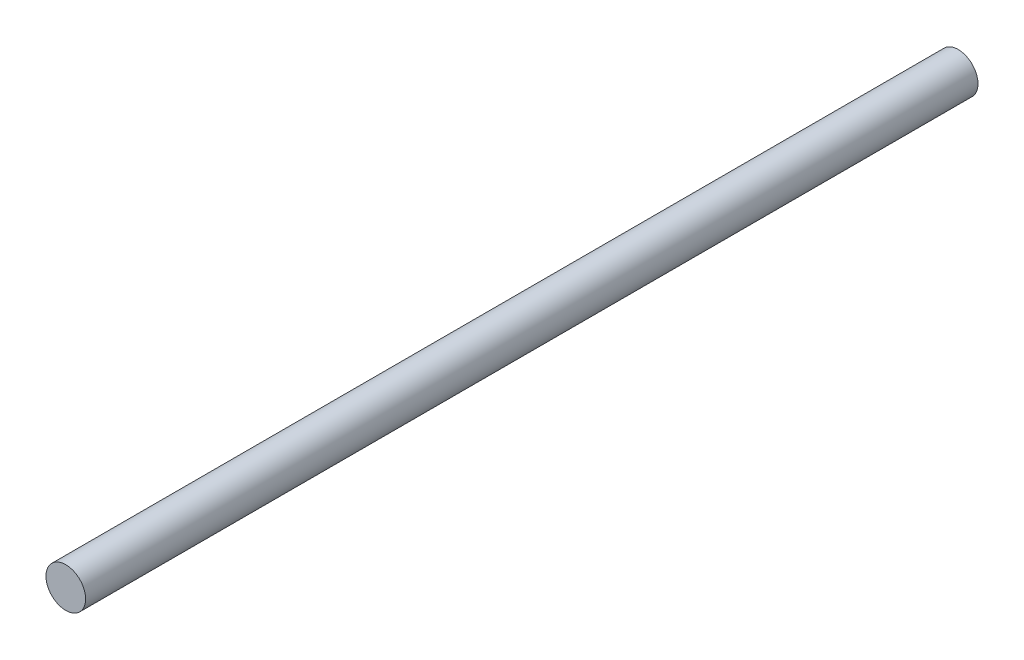
ISO-10303-21;
HEADER;
FILE_DESCRIPTION(('STEP AP214'),'2;1');
FILE_NAME('part.step','',(''),(''),'','','');
FILE_SCHEMA(('AUTOMOTIVE_DESIGN { 1 0 10303 214 1 1 1 1 }'));
ENDSEC;
DATA;
#1=APPLICATION_CONTEXT('core data for automotive mechanical design processes');
#2=APPLICATION_PROTOCOL_DEFINITION('international standard','automotive_design',2000,#1);
#3=PRODUCT_CONTEXT('',#1,'mechanical');
#4=PRODUCT('Part','Part','',(#3));
#5=PRODUCT_RELATED_PRODUCT_CATEGORY('part','',(#4));
#6=PRODUCT_DEFINITION_FORMATION('','',#4);
#7=PRODUCT_DEFINITION_CONTEXT('part definition',#1,'design');
#8=PRODUCT_DEFINITION('design','',#6,#7);
#9=PRODUCT_DEFINITION_SHAPE('','',#8);
#10=(LENGTH_UNIT() NAMED_UNIT(*) SI_UNIT(.MILLI.,.METRE.));
#11=(NAMED_UNIT(*) PLANE_ANGLE_UNIT() SI_UNIT($,.RADIAN.));
#12=(NAMED_UNIT(*) SI_UNIT($,.STERADIAN.) SOLID_ANGLE_UNIT());
#13=UNCERTAINTY_MEASURE_WITH_UNIT(LENGTH_MEASURE(1.E-05),#10,'distance_accuracy_value','');
#14=(GEOMETRIC_REPRESENTATION_CONTEXT(3) GLOBAL_UNCERTAINTY_ASSIGNED_CONTEXT((#13)) GLOBAL_UNIT_ASSIGNED_CONTEXT((#10,
#11,#12)) REPRESENTATION_CONTEXT('',''));
#15=CARTESIAN_POINT('',(0.,0.,0.));
#16=DIRECTION('',(0.,0.,1.));
#17=DIRECTION('',(1.,0.,0.));
#18=AXIS2_PLACEMENT_3D('',#15,#16,#17);
#19=CARTESIAN_POINT('',(0.,0.,450.));
#20=DIRECTION('',(0.,0.,-1.));
#21=DIRECTION('',(-1.,0.,0.));
#22=AXIS2_PLACEMENT_3D('',#19,#20,#21);
#23=CYLINDRICAL_SURFACE('',#22,10.);
#24=CARTESIAN_POINT('',(0.,0.,450.));
#25=DIRECTION('',(0.,0.,1.));
#26=DIRECTION('',(1.,0.,0.));
#27=AXIS2_PLACEMENT_3D('',#24,#25,#26);
#28=CIRCLE('',#27,10.);
#29=CARTESIAN_POINT('',(10.,0.,450.));
#30=VERTEX_POINT('',#29);
#31=EDGE_CURVE('E10',#30,#30,#28,.T.);
#32=ORIENTED_EDGE('',*,*,#31,.F.);
#33=EDGE_LOOP('',(#32));
#34=FACE_BOUND('',#33,.T.);
#35=CARTESIAN_POINT('',(0.,0.,0.));
#36=DIRECTION('',(0.,0.,1.));
#37=DIRECTION('',(1.,0.,0.));
#38=AXIS2_PLACEMENT_3D('',#35,#36,#37);
#39=CIRCLE('',#38,10.);
#40=CARTESIAN_POINT('',(10.,0.,0.));
#41=VERTEX_POINT('',#40);
#42=EDGE_CURVE('E34',#41,#41,#39,.T.);
#43=ORIENTED_EDGE('',*,*,#42,.T.);
#44=EDGE_LOOP('',(#43));
#45=FACE_BOUND('',#44,.T.);
#46=ADVANCED_FACE('F31',(#34,#45),#23,.T.);
#47=CARTESIAN_POINT('',(0.,0.,450.));
#48=DIRECTION('',(0.,0.,1.));
#49=DIRECTION('',(1.,0.,0.));
#50=AXIS2_PLACEMENT_3D('',#47,#48,#49);
#51=PLANE('',#50);
#52=ORIENTED_EDGE('',*,*,#31,.T.);
#53=EDGE_LOOP('',(#52));
#54=FACE_BOUND('',#53,.T.);
#55=ADVANCED_FACE('F46',(#54),#51,.T.);
#56=CARTESIAN_POINT('',(0.,0.,0.));
#57=DIRECTION('',(0.,0.,1.));
#58=DIRECTION('',(1.,0.,0.));
#59=AXIS2_PLACEMENT_3D('',#56,#57,#58);
#60=PLANE('',#59);
#61=ORIENTED_EDGE('',*,*,#42,.F.);
#62=EDGE_LOOP('',(#61));
#63=FACE_BOUND('',#62,.T.);
#64=ADVANCED_FACE('F44',(#63),#60,.F.);
#65=CLOSED_SHELL('',(#46,#55,#64));
#66=MANIFOLD_SOLID_BREP('B2',#65);
#67=ADVANCED_BREP_SHAPE_REPRESENTATION('',(#18,#66),#14);
#68=SHAPE_DEFINITION_REPRESENTATION(#9,#67);
ENDSEC;
END-ISO-10303-21;
